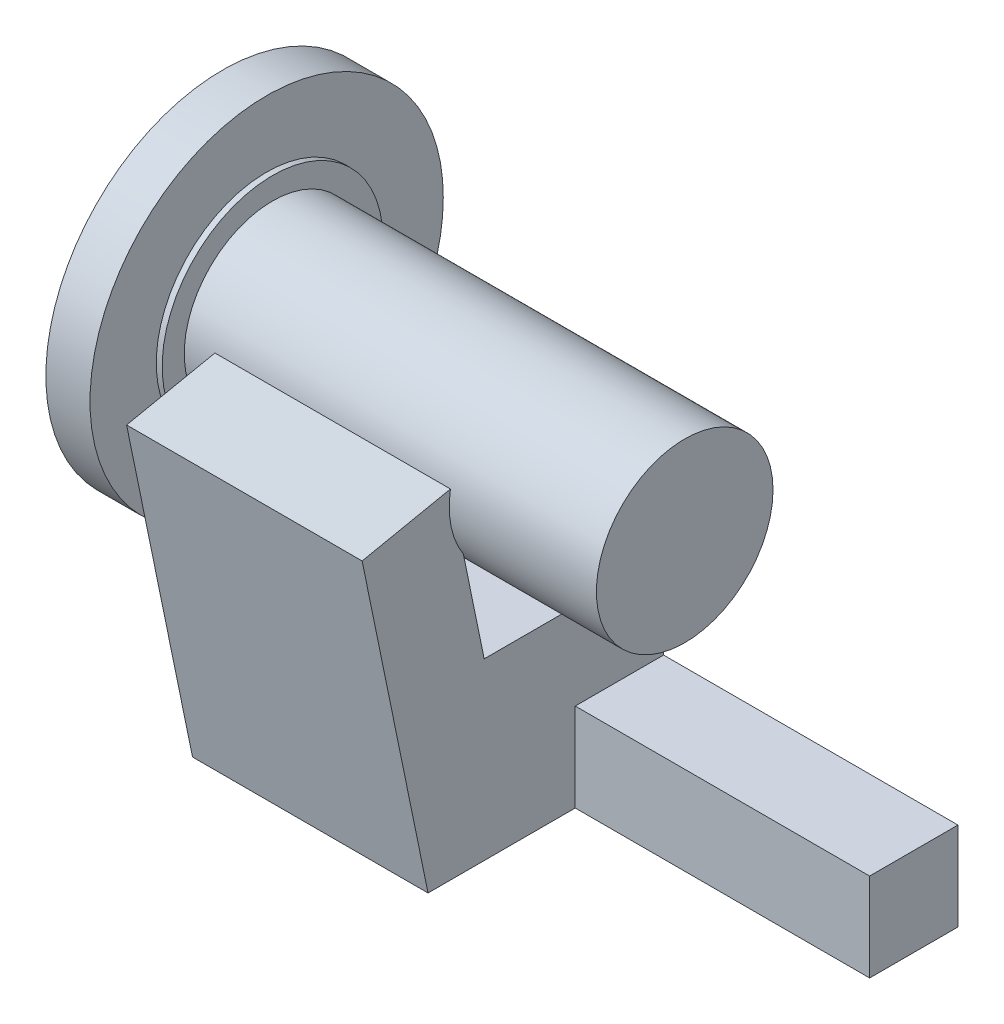
ISO-10303-21;
HEADER;
FILE_DESCRIPTION(('STEP AP214'),'2;1');
FILE_NAME('part.step','',(''),(''),'','','');
FILE_SCHEMA(('AUTOMOTIVE_DESIGN { 1 0 10303 214 1 1 1 1 }'));
ENDSEC;
DATA;
#1=APPLICATION_CONTEXT('core data for automotive mechanical design processes');
#2=APPLICATION_PROTOCOL_DEFINITION('international standard','automotive_design',2000,#1);
#3=PRODUCT_CONTEXT('',#1,'mechanical');
#4=PRODUCT('Part','Part','',(#3));
#5=PRODUCT_RELATED_PRODUCT_CATEGORY('part','',(#4));
#6=PRODUCT_DEFINITION_FORMATION('','',#4);
#7=PRODUCT_DEFINITION_CONTEXT('part definition',#1,'design');
#8=PRODUCT_DEFINITION('design','',#6,#7);
#9=PRODUCT_DEFINITION_SHAPE('','',#8);
#10=(LENGTH_UNIT() NAMED_UNIT(*) SI_UNIT(.MILLI.,.METRE.));
#11=(NAMED_UNIT(*) PLANE_ANGLE_UNIT() SI_UNIT($,.RADIAN.));
#12=(NAMED_UNIT(*) SI_UNIT($,.STERADIAN.) SOLID_ANGLE_UNIT());
#13=UNCERTAINTY_MEASURE_WITH_UNIT(LENGTH_MEASURE(1.E-05),#10,'distance_accuracy_value','');
#14=(GEOMETRIC_REPRESENTATION_CONTEXT(3) GLOBAL_UNCERTAINTY_ASSIGNED_CONTEXT((#13)) GLOBAL_UNIT_ASSIGNED_CONTEXT((#10,
#11,#12)) REPRESENTATION_CONTEXT('',''));
#15=CARTESIAN_POINT('',(0.,0.,0.));
#16=DIRECTION('',(0.,0.,1.));
#17=DIRECTION('',(1.,0.,0.));
#18=AXIS2_PLACEMENT_3D('',#15,#16,#17);
#19=CARTESIAN_POINT('',(135.89,-139.7,47.2196996677353));
#20=DIRECTION('',(0.,1.,0.));
#21=DIRECTION('',(0.,0.,1.));
#22=AXIS2_PLACEMENT_3D('',#19,#20,#21);
#23=PLANE('',#22);
#24=CARTESIAN_POINT('',(40.64,-139.7,-48.0303003322647));
#25=DIRECTION('',(0.,-1.,0.));
#26=DIRECTION('',(0.,0.,-1.));
#27=AXIS2_PLACEMENT_3D('',#24,#25,#26);
#28=CIRCLE('',#27,6.35);
#29=CARTESIAN_POINT('',(40.64,-139.7,-54.3803003322647));
#30=VERTEX_POINT('',#29);
#31=CARTESIAN_POINT('',(34.29,-139.7,-48.0303003322647));
#32=VERTEX_POINT('',#31);
#33=EDGE_CURVE('E50',#30,#32,#28,.T.);
#34=ORIENTED_EDGE('',*,*,#33,.F.);
#35=DIRECTION('',(-1.,0.,0.));
#36=VECTOR('',#35,1.);
#37=CARTESIAN_POINT('',(135.89,-139.7,-54.3803003322647));
#38=LINE('',#37,#36);
#39=CARTESIAN_POINT('',(262.89,-139.7,-54.3803003322647));
#40=VERTEX_POINT('',#39);
#41=EDGE_CURVE('E154',#40,#30,#38,.T.);
#42=ORIENTED_EDGE('',*,*,#41,.F.);
#43=DIRECTION('',(0.,0.,-1.));
#44=VECTOR('',#43,1.);
#45=CARTESIAN_POINT('',(262.89,-139.7,-54.3803003322647));
#46=LINE('',#45,#44);
#47=CARTESIAN_POINT('',(262.89,-139.7,-16.2803003322647));
#48=VERTEX_POINT('',#47);
#49=EDGE_CURVE('E558',#48,#40,#46,.T.);
#50=ORIENTED_EDGE('',*,*,#49,.F.);
#51=DIRECTION('',(-1.,0.,0.));
#52=VECTOR('',#51,1.);
#53=CARTESIAN_POINT('',(262.89,-139.7,-16.2803003322647));
#54=LINE('',#53,#52);
#55=CARTESIAN_POINT('',(135.89,-139.7,-16.2803003322647));
#56=VERTEX_POINT('',#55);
#57=EDGE_CURVE('E560',#48,#56,#54,.T.);
#58=ORIENTED_EDGE('',*,*,#57,.T.);
#59=DIRECTION('',(0.,0.,-1.));
#60=VECTOR('',#59,1.);
#61=CARTESIAN_POINT('',(135.89,-139.7,47.2196996677353));
#62=LINE('',#61,#60);
#63=CARTESIAN_POINT('',(135.89,-139.7,47.2196996677353));
#64=VERTEX_POINT('',#63);
#65=EDGE_CURVE('E540',#64,#56,#62,.T.);
#66=ORIENTED_EDGE('',*,*,#65,.F.);
#67=DIRECTION('',(-1.,0.,0.));
#68=VECTOR('',#67,1.);
#69=CARTESIAN_POINT('',(135.89,-139.7,47.2196996677353));
#70=LINE('',#69,#68);
#71=CARTESIAN_POINT('',(34.29,-139.7,47.2196996677353));
#72=VERTEX_POINT('',#71);
#73=EDGE_CURVE('E165',#64,#72,#70,.T.);
#74=ORIENTED_EDGE('',*,*,#73,.T.);
#75=DIRECTION('',(0.,0.,-1.));
#76=VECTOR('',#75,1.);
#77=CARTESIAN_POINT('',(34.29,-139.7,47.2196996677353));
#78=LINE('',#77,#76);
#79=EDGE_CURVE('E176',#72,#32,#78,.T.);
#80=ORIENTED_EDGE('',*,*,#79,.T.);
#81=EDGE_LOOP('',(#34,#42,#50,#58,#66,#74,#80));
#82=FACE_BOUND('',#81,.T.);
#83=ADVANCED_FACE('F39',(#82),#23,.F.);
#84=CARTESIAN_POINT('',(135.89,-86.8248677252122,-31.8863005314087));
#85=DIRECTION('',(-1.,0.,0.));
#86=DIRECTION('',(0.,0.,1.));
#87=AXIS2_PLACEMENT_3D('',#84,#85,#86);
#88=PLANE('',#87);
#89=DIRECTION('',(0.,0.,1.));
#90=VECTOR('',#89,1.);
#91=CARTESIAN_POINT('',(135.89,-101.6,-54.3803003322647));
#92=LINE('',#91,#90);
#93=CARTESIAN_POINT('',(135.89,-101.6,-54.3803003322647));
#94=VERTEX_POINT('',#93);
#95=CARTESIAN_POINT('',(135.89,-101.6,-16.2803003322647));
#96=VERTEX_POINT('',#95);
#97=EDGE_CURVE('E545',#94,#96,#92,.T.);
#98=ORIENTED_EDGE('',*,*,#97,.F.);
#99=DIRECTION('',(0.,1.,0.));
#100=VECTOR('',#99,1.);
#101=CARTESIAN_POINT('',(135.89,-139.7,-54.3803003322647));
#102=LINE('',#101,#100);
#103=CARTESIAN_POINT('',(135.89,-87.28092842014,-54.3803003322647));
#104=VERTEX_POINT('',#103);
#105=EDGE_CURVE('E575',#94,#104,#102,.T.);
#106=ORIENTED_EDGE('',*,*,#105,.T.);
#107=CARTESIAN_POINT('',(135.89,-86.8248677252122,-31.8863005314087));
#108=DIRECTION('',(1.,0.,0.));
#109=DIRECTION('',(0.,0.,1.));
#110=AXIS2_PLACEMENT_3D('',#107,#108,#109);
#111=CIRCLE('',#110,22.4986225889134);
#112=CARTESIAN_POINT('',(135.89,-64.3267940051332,-31.7291468351346));
#113=VERTEX_POINT('',#112);
#114=EDGE_CURVE('E577',#104,#113,#111,.T.);
#115=ORIENTED_EDGE('',*,*,#114,.T.);
#116=DIRECTION('',(0.,0.,1.));
#117=VECTOR('',#116,1.);
#118=CARTESIAN_POINT('',(135.89,-64.3267940051332,23.0084777290384));
#119=LINE('',#118,#117);
#120=CARTESIAN_POINT('',(135.89,-64.3267940051332,23.0084777290384));
#121=VERTEX_POINT('',#120);
#122=EDGE_CURVE('E515',#113,#121,#119,.T.);
#123=ORIENTED_EDGE('',*,*,#122,.T.);
#124=DIRECTION('',(0.,0.979503263535458,0.201428291765052));
#125=VECTOR('',#124,1.);
#126=CARTESIAN_POINT('',(135.89,6.41501983264387,37.5560583734074));
#127=LINE('',#126,#125);
#128=CARTESIAN_POINT('',(135.89,-20.71405784,31.9771450852188));
#129=VERTEX_POINT('',#128);
#130=EDGE_CURVE('E297',#121,#129,#127,.T.);
#131=ORIENTED_EDGE('',*,*,#130,.T.);
#132=CARTESIAN_POINT('',(135.89,0.,0.));
#133=DIRECTION('',(-1.,0.,0.));
#134=DIRECTION('',(0.,0.,1.));
#135=AXIS2_PLACEMENT_3D('',#132,#133,#134);
#136=CIRCLE('',#135,38.1);
#137=CARTESIAN_POINT('',(135.89,6.41501983264387,37.5560583734074));
#138=VERTEX_POINT('',#137);
#139=EDGE_CURVE('E43',#129,#138,#136,.T.);
#140=ORIENTED_EDGE('',*,*,#139,.T.);
#141=DIRECTION('',(0.,-0.201428291765052,0.979503263535458));
#142=VECTOR('',#141,1.);
#143=CARTESIAN_POINT('',(135.89,6.41501983264387,37.5560583734074));
#144=LINE('',#143,#142);
#145=CARTESIAN_POINT('',(135.89,-1.41999021984755,75.6560583734074));
#146=VERTEX_POINT('',#145);
#147=EDGE_CURVE('E295',#138,#146,#144,.T.);
#148=ORIENTED_EDGE('',*,*,#147,.T.);
#149=DIRECTION('',(0.,-0.979503263535458,-0.201428291765052));
#150=VECTOR('',#149,1.);
#151=CARTESIAN_POINT('',(135.89,-1.41999021984755,75.6560583734074));
#152=LINE('',#151,#150);
#153=EDGE_CURVE('E306',#146,#64,#152,.T.);
#154=ORIENTED_EDGE('',*,*,#153,.T.);
#155=ORIENTED_EDGE('',*,*,#65,.T.);
#156=DIRECTION('',(0.,-1.,0.));
#157=VECTOR('',#156,1.);
#158=CARTESIAN_POINT('',(135.89,-139.7,-16.2803003322647));
#159=LINE('',#158,#157);
#160=EDGE_CURVE('E69',#96,#56,#159,.T.);
#161=ORIENTED_EDGE('',*,*,#160,.F.);
#162=EDGE_LOOP('',(#98,#106,#115,#123,#131,#140,#148,#154,#155,#161));
#163=FACE_BOUND('',#162,.T.);
#164=ADVANCED_FACE('F197',(#163),#88,.F.);
#165=CARTESIAN_POINT('',(199.39,0.,0.));
#166=DIRECTION('',(-1.,0.,0.));
#167=DIRECTION('',(0.,0.,1.));
#168=AXIS2_PLACEMENT_3D('',#165,#166,#167);
#169=CYLINDRICAL_SURFACE('',#168,38.1);
#170=CARTESIAN_POINT('',(21.59,0.,0.));
#171=DIRECTION('',(1.,0.,0.));
#172=DIRECTION('',(0.,0.,-1.));
#173=AXIS2_PLACEMENT_3D('',#170,#171,#172);
#174=CIRCLE('',#173,38.1);
#175=CARTESIAN_POINT('',(21.59,0.,-38.1));
#176=VERTEX_POINT('',#175);
#177=EDGE_CURVE('E318',#176,#176,#174,.T.);
#178=ORIENTED_EDGE('',*,*,#177,.T.);
#179=EDGE_LOOP('',(#178));
#180=FACE_BOUND('',#179,.T.);
#181=CARTESIAN_POINT('',(199.39,0.,0.));
#182=DIRECTION('',(1.,0.,0.));
#183=DIRECTION('',(0.,0.,-1.));
#184=AXIS2_PLACEMENT_3D('',#181,#182,#183);
#185=CIRCLE('',#184,38.1);
#186=CARTESIAN_POINT('',(199.39,0.,-38.1));
#187=VERTEX_POINT('',#186);
#188=EDGE_CURVE('E276',#187,#187,#185,.T.);
#189=ORIENTED_EDGE('',*,*,#188,.F.);
#190=EDGE_LOOP('',(#189));
#191=FACE_BOUND('',#190,.T.);
#192=ORIENTED_EDGE('',*,*,#139,.F.);
#193=DIRECTION('',(-1.,0.,0.));
#194=VECTOR('',#193,1.);
#195=CARTESIAN_POINT('',(199.39,-20.71405784,31.9771450852188));
#196=LINE('',#195,#194);
#197=CARTESIAN_POINT('',(34.29,-20.71405784,31.9771450852188));
#198=VERTEX_POINT('',#197);
#199=EDGE_CURVE('E283',#198,#129,#196,.F.);
#200=ORIENTED_EDGE('',*,*,#199,.F.);
#201=CARTESIAN_POINT('',(34.29,0.,0.));
#202=DIRECTION('',(-1.,0.,0.));
#203=DIRECTION('',(0.,0.,1.));
#204=AXIS2_PLACEMENT_3D('',#201,#202,#203);
#205=CIRCLE('',#204,38.1);
#206=CARTESIAN_POINT('',(34.29,6.41501983264386,37.5560583734074));
#207=VERTEX_POINT('',#206);
#208=EDGE_CURVE('E280',#198,#207,#205,.T.);
#209=ORIENTED_EDGE('',*,*,#208,.T.);
#210=DIRECTION('',(-1.,0.,0.));
#211=VECTOR('',#210,1.);
#212=CARTESIAN_POINT('',(135.89,6.41501983264387,37.5560583734074));
#213=LINE('',#212,#211);
#214=EDGE_CURVE('E300',#138,#207,#213,.T.);
#215=ORIENTED_EDGE('',*,*,#214,.F.);
#216=EDGE_LOOP('',(#192,#200,#209,#215));
#217=FACE_BOUND('',#216,.T.);
#218=ADVANCED_FACE('F202',(#180,#191,#217),#169,.T.);
#219=CARTESIAN_POINT('',(19.05,0.,0.));
#220=DIRECTION('',(-1.,0.,0.));
#221=DIRECTION('',(0.,0.,1.));
#222=AXIS2_PLACEMENT_3D('',#219,#220,#221);
#223=CYLINDRICAL_SURFACE('',#222,76.2);
#224=CARTESIAN_POINT('',(19.05,0.,0.));
#225=DIRECTION('',(1.,0.,0.));
#226=DIRECTION('',(0.,0.,-1.));
#227=AXIS2_PLACEMENT_3D('',#224,#225,#226);
#228=CIRCLE('',#227,76.2);
#229=CARTESIAN_POINT('',(19.05,0.,-76.2));
#230=VERTEX_POINT('',#229);
#231=EDGE_CURVE('E265',#230,#230,#228,.T.);
#232=ORIENTED_EDGE('',*,*,#231,.F.);
#233=EDGE_LOOP('',(#232));
#234=FACE_BOUND('',#233,.T.);
#235=CARTESIAN_POINT('',(0.,0.,0.));
#236=DIRECTION('',(1.,0.,0.));
#237=DIRECTION('',(0.,0.,-1.));
#238=AXIS2_PLACEMENT_3D('',#235,#236,#237);
#239=CIRCLE('',#238,76.2);
#240=CARTESIAN_POINT('',(0.,0.,-76.2));
#241=VERTEX_POINT('',#240);
#242=EDGE_CURVE('E262',#241,#241,#239,.T.);
#243=ORIENTED_EDGE('',*,*,#242,.T.);
#244=EDGE_LOOP('',(#243));
#245=FACE_BOUND('',#244,.T.);
#246=ADVANCED_FACE('F41',(#234,#245),#223,.T.);
#247=CARTESIAN_POINT('',(19.05,0.,0.));
#248=DIRECTION('',(1.,0.,0.));
#249=DIRECTION('',(0.,0.,-1.));
#250=AXIS2_PLACEMENT_3D('',#247,#248,#249);
#251=PLANE('',#250);
#252=CARTESIAN_POINT('',(19.05,0.,0.));
#253=DIRECTION('',(1.,0.,0.));
#254=DIRECTION('',(0.,0.,-1.));
#255=AXIS2_PLACEMENT_3D('',#252,#253,#254);
#256=CIRCLE('',#255,47.625);
#257=CARTESIAN_POINT('',(19.05,0.,-47.625));
#258=VERTEX_POINT('',#257);
#259=EDGE_CURVE('E272',#258,#258,#256,.T.);
#260=ORIENTED_EDGE('',*,*,#259,.F.);
#261=EDGE_LOOP('',(#260));
#262=FACE_BOUND('',#261,.T.);
#263=ORIENTED_EDGE('',*,*,#231,.T.);
#264=EDGE_LOOP('',(#263));
#265=FACE_BOUND('',#264,.T.);
#266=ADVANCED_FACE('F249',(#262,#265),#251,.T.);
#267=CARTESIAN_POINT('',(0.,0.,0.));
#268=DIRECTION('',(1.,0.,0.));
#269=DIRECTION('',(0.,0.,-1.));
#270=AXIS2_PLACEMENT_3D('',#267,#268,#269);
#271=PLANE('',#270);
#272=CARTESIAN_POINT('',(0.,0.,0.));
#273=DIRECTION('',(-1.,0.,0.));
#274=DIRECTION('',(0.,0.,1.));
#275=AXIS2_PLACEMENT_3D('',#272,#273,#274);
#276=CIRCLE('',#275,12.7);
#277=CARTESIAN_POINT('',(0.,0.,12.7));
#278=VERTEX_POINT('',#277);
#279=EDGE_CURVE('E259',#278,#278,#276,.T.);
#280=ORIENTED_EDGE('',*,*,#279,.F.);
#281=EDGE_LOOP('',(#280));
#282=FACE_BOUND('',#281,.T.);
#283=ORIENTED_EDGE('',*,*,#242,.F.);
#284=EDGE_LOOP('',(#283));
#285=FACE_BOUND('',#284,.T.);
#286=ADVANCED_FACE('F247',(#282,#285),#271,.F.);
#287=CARTESIAN_POINT('',(21.59,0.,0.));
#288=DIRECTION('',(-1.,0.,0.));
#289=DIRECTION('',(0.,0.,1.));
#290=AXIS2_PLACEMENT_3D('',#287,#288,#289);
#291=CYLINDRICAL_SURFACE('',#290,47.625);
#292=CARTESIAN_POINT('',(21.59,0.,0.));
#293=DIRECTION('',(1.,0.,0.));
#294=DIRECTION('',(0.,0.,-1.));
#295=AXIS2_PLACEMENT_3D('',#292,#293,#294);
#296=CIRCLE('',#295,47.625);
#297=CARTESIAN_POINT('',(21.59,0.,-47.625));
#298=VERTEX_POINT('',#297);
#299=EDGE_CURVE('E266',#298,#298,#296,.T.);
#300=ORIENTED_EDGE('',*,*,#299,.F.);
#301=EDGE_LOOP('',(#300));
#302=FACE_BOUND('',#301,.T.);
#303=ORIENTED_EDGE('',*,*,#259,.T.);
#304=EDGE_LOOP('',(#303));
#305=FACE_BOUND('',#304,.T.);
#306=ADVANCED_FACE('F243',(#302,#305),#291,.T.);
#307=CARTESIAN_POINT('',(21.59,0.,0.));
#308=DIRECTION('',(1.,0.,0.));
#309=DIRECTION('',(0.,0.,-1.));
#310=AXIS2_PLACEMENT_3D('',#307,#308,#309);
#311=PLANE('',#310);
#312=ORIENTED_EDGE('',*,*,#177,.F.);
#313=EDGE_LOOP('',(#312));
#314=FACE_BOUND('',#313,.T.);
#315=ORIENTED_EDGE('',*,*,#299,.T.);
#316=EDGE_LOOP('',(#315));
#317=FACE_BOUND('',#316,.T.);
#318=ADVANCED_FACE('F236',(#314,#317),#311,.T.);
#319=CARTESIAN_POINT('',(199.39,0.,0.));
#320=DIRECTION('',(1.,0.,0.));
#321=DIRECTION('',(0.,0.,-1.));
#322=AXIS2_PLACEMENT_3D('',#319,#320,#321);
#323=PLANE('',#322);
#324=ORIENTED_EDGE('',*,*,#188,.T.);
#325=EDGE_LOOP('',(#324));
#326=FACE_BOUND('',#325,.T.);
#327=ADVANCED_FACE('F232',(#326),#323,.T.);
#328=CARTESIAN_POINT('',(-31.75,0.,0.));
#329=DIRECTION('',(1.,0.,0.));
#330=DIRECTION('',(0.,0.,-1.));
#331=AXIS2_PLACEMENT_3D('',#328,#329,#330);
#332=CYLINDRICAL_SURFACE('',#331,12.7);
#333=CARTESIAN_POINT('',(-31.75,0.,0.));
#334=DIRECTION('',(-1.,0.,0.));
#335=DIRECTION('',(0.,0.,1.));
#336=AXIS2_PLACEMENT_3D('',#333,#334,#335);
#337=CIRCLE('',#336,12.7);
#338=CARTESIAN_POINT('',(-31.75,0.,12.7));
#339=VERTEX_POINT('',#338);
#340=EDGE_CURVE('E308',#339,#339,#337,.T.);
#341=ORIENTED_EDGE('',*,*,#340,.F.);
#342=EDGE_LOOP('',(#341));
#343=FACE_BOUND('',#342,.T.);
#344=ORIENTED_EDGE('',*,*,#279,.T.);
#345=EDGE_LOOP('',(#344));
#346=FACE_BOUND('',#345,.T.);
#347=ADVANCED_FACE('F228',(#343,#346),#332,.T.);
#348=CARTESIAN_POINT('',(-31.75,0.,0.));
#349=DIRECTION('',(-1.,0.,0.));
#350=DIRECTION('',(0.,0.,1.));
#351=AXIS2_PLACEMENT_3D('',#348,#349,#350);
#352=PLANE('',#351);
#353=ORIENTED_EDGE('',*,*,#340,.T.);
#354=EDGE_LOOP('',(#353));
#355=FACE_BOUND('',#354,.T.);
#356=ADVANCED_FACE('F224',(#355),#352,.T.);
#357=CARTESIAN_POINT('',(135.89,6.41501983264387,37.5560583734074));
#358=DIRECTION('',(0.,-0.201428291765052,0.979503263535458));
#359=DIRECTION('',(0.,-0.979503263535458,-0.201428291765052));
#360=AXIS2_PLACEMENT_3D('',#357,#358,#359);
#361=PLANE('',#360);
#362=DIRECTION('',(0.,0.979503263535458,0.201428291765052));
#363=VECTOR('',#362,1.);
#364=CARTESIAN_POINT('',(34.29,6.41501983264387,37.5560583734074));
#365=LINE('',#364,#363);
#366=CARTESIAN_POINT('',(34.29,-64.3267940051332,23.0084777290384));
#367=VERTEX_POINT('',#366);
#368=EDGE_CURVE('E497',#367,#198,#365,.T.);
#369=ORIENTED_EDGE('',*,*,#368,.T.);
#370=ORIENTED_EDGE('',*,*,#199,.T.);
#371=ORIENTED_EDGE('',*,*,#130,.F.);
#372=DIRECTION('',(-1.,0.,0.));
#373=VECTOR('',#372,1.);
#374=CARTESIAN_POINT('',(135.89,-64.3267940051332,23.0084777290384));
#375=LINE('',#374,#373);
#376=EDGE_CURVE('E502',#121,#367,#375,.T.);
#377=ORIENTED_EDGE('',*,*,#376,.T.);
#378=EDGE_LOOP('',(#369,#370,#371,#377));
#379=FACE_BOUND('',#378,.T.);
#380=ADVANCED_FACE('F218',(#379),#361,.F.);
#381=CARTESIAN_POINT('',(135.89,6.41501983264387,37.5560583734074));
#382=DIRECTION('',(0.,-0.979503263535458,-0.201428291765052));
#383=DIRECTION('',(0.,0.201428291765052,-0.979503263535458));
#384=AXIS2_PLACEMENT_3D('',#381,#382,#383);
#385=PLANE('',#384);
#386=DIRECTION('',(0.,-0.201428291765052,0.979503263535458));
#387=VECTOR('',#386,1.);
#388=CARTESIAN_POINT('',(34.29,6.41501983264387,37.5560583734074));
#389=LINE('',#388,#387);
#390=CARTESIAN_POINT('',(34.29,-1.41999021984755,75.6560583734074));
#391=VERTEX_POINT('',#390);
#392=EDGE_CURVE('E499',#207,#391,#389,.T.);
#393=ORIENTED_EDGE('',*,*,#392,.T.);
#394=DIRECTION('',(-1.,0.,0.));
#395=VECTOR('',#394,1.);
#396=CARTESIAN_POINT('',(135.89,-1.41999021984755,75.6560583734074));
#397=LINE('',#396,#395);
#398=EDGE_CURVE('E303',#146,#391,#397,.T.);
#399=ORIENTED_EDGE('',*,*,#398,.F.);
#400=ORIENTED_EDGE('',*,*,#147,.F.);
#401=ORIENTED_EDGE('',*,*,#214,.T.);
#402=EDGE_LOOP('',(#393,#399,#400,#401));
#403=FACE_BOUND('',#402,.T.);
#404=ADVANCED_FACE('F213',(#403),#385,.F.);
#405=CARTESIAN_POINT('',(135.89,-1.41999021984755,75.6560583734074));
#406=DIRECTION('',(0.,0.201428291765052,-0.979503263535458));
#407=DIRECTION('',(0.,0.979503263535458,0.201428291765052));
#408=AXIS2_PLACEMENT_3D('',#405,#406,#407);
#409=PLANE('',#408);
#410=DIRECTION('',(0.,-0.979503263535458,-0.201428291765052));
#411=VECTOR('',#410,1.);
#412=CARTESIAN_POINT('',(34.29,-1.41999021984755,75.6560583734074));
#413=LINE('',#412,#411);
#414=EDGE_CURVE('E508',#391,#72,#413,.T.);
#415=ORIENTED_EDGE('',*,*,#414,.T.);
#416=ORIENTED_EDGE('',*,*,#73,.F.);
#417=ORIENTED_EDGE('',*,*,#153,.F.);
#418=ORIENTED_EDGE('',*,*,#398,.T.);
#419=EDGE_LOOP('',(#415,#416,#417,#418));
#420=FACE_BOUND('',#419,.T.);
#421=ADVANCED_FACE('F207',(#420),#409,.F.);
#422=EDGE_CURVE('E11',#32,#30,#28,.T.);
#423=ORIENTED_EDGE('',*,*,#422,.F.);
#424=CARTESIAN_POINT('',(34.29,-139.7,-54.3803003322647));
#425=VERTEX_POINT('',#424);
#426=EDGE_CURVE('E168',#32,#425,#78,.T.);
#427=ORIENTED_EDGE('',*,*,#426,.T.);
#428=EDGE_CURVE('E156',#30,#425,#38,.T.);
#429=ORIENTED_EDGE('',*,*,#428,.F.);
#430=EDGE_LOOP('',(#423,#427,#429));
#431=FACE_BOUND('',#430,.T.);
#432=ADVANCED_FACE('F167',(#431),#23,.F.);
#433=CARTESIAN_POINT('',(135.89,-87.28092842014,-54.3803003322647));
#434=DIRECTION('',(0.,0.,1.));
#435=DIRECTION('',(1.,0.,0.));
#436=AXIS2_PLACEMENT_3D('',#433,#434,#435);
#437=PLANE('',#436);
#438=DIRECTION('',(0.,1.,0.));
#439=VECTOR('',#438,1.);
#440=CARTESIAN_POINT('',(34.29,-87.28092842014,-54.3803003322647));
#441=LINE('',#440,#439);
#442=CARTESIAN_POINT('',(34.29,-87.28092842014,-54.3803003322647));
#443=VERTEX_POINT('',#442);
#444=EDGE_CURVE('E521',#425,#443,#441,.T.);
#445=ORIENTED_EDGE('',*,*,#444,.T.);
#446=DIRECTION('',(-1.,0.,0.));
#447=VECTOR('',#446,1.);
#448=CARTESIAN_POINT('',(135.89,-87.28092842014,-54.3803003322647));
#449=LINE('',#448,#447);
#450=EDGE_CURVE('E171',#104,#443,#449,.T.);
#451=ORIENTED_EDGE('',*,*,#450,.F.);
#452=ORIENTED_EDGE('',*,*,#105,.F.);
#453=DIRECTION('',(-1.,0.,0.));
#454=VECTOR('',#453,1.);
#455=CARTESIAN_POINT('',(262.89,-101.6,-54.3803003322647));
#456=LINE('',#455,#454);
#457=CARTESIAN_POINT('',(262.89,-101.6,-54.3803003322647));
#458=VERTEX_POINT('',#457);
#459=EDGE_CURVE('E504',#458,#94,#456,.T.);
#460=ORIENTED_EDGE('',*,*,#459,.F.);
#461=DIRECTION('',(0.,1.,0.));
#462=VECTOR('',#461,1.);
#463=CARTESIAN_POINT('',(262.89,-139.7,-54.3803003322647));
#464=LINE('',#463,#462);
#465=EDGE_CURVE('E159',#40,#458,#464,.T.);
#466=ORIENTED_EDGE('',*,*,#465,.F.);
#467=ORIENTED_EDGE('',*,*,#41,.T.);
#468=ORIENTED_EDGE('',*,*,#428,.T.);
#469=EDGE_LOOP('',(#445,#451,#452,#460,#466,#467,#468));
#470=FACE_BOUND('',#469,.T.);
#471=ADVANCED_FACE('F155',(#470),#437,.F.);
#472=CARTESIAN_POINT('',(135.89,-86.8248677252122,-31.8863005314087));
#473=DIRECTION('',(-1.,0.,0.));
#474=DIRECTION('',(0.,0.,1.));
#475=AXIS2_PLACEMENT_3D('',#472,#473,#474);
#476=CYLINDRICAL_SURFACE('',#475,22.4986225889134);
#477=CARTESIAN_POINT('',(34.29,-86.8248677252122,-31.8863005314087));
#478=DIRECTION('',(1.,0.,0.));
#479=DIRECTION('',(0.,0.,1.));
#480=AXIS2_PLACEMENT_3D('',#477,#478,#479);
#481=CIRCLE('',#480,22.4986225889134);
#482=CARTESIAN_POINT('',(34.29,-64.3267940051332,-31.7291468351346));
#483=VERTEX_POINT('',#482);
#484=EDGE_CURVE('E524',#443,#483,#481,.T.);
#485=ORIENTED_EDGE('',*,*,#484,.T.);
#486=DIRECTION('',(-1.,0.,0.));
#487=VECTOR('',#486,1.);
#488=CARTESIAN_POINT('',(135.89,-64.3267940051332,-31.7291468351346));
#489=LINE('',#488,#487);
#490=EDGE_CURVE('E531',#113,#483,#489,.T.);
#491=ORIENTED_EDGE('',*,*,#490,.F.);
#492=ORIENTED_EDGE('',*,*,#114,.F.);
#493=ORIENTED_EDGE('',*,*,#450,.T.);
#494=EDGE_LOOP('',(#485,#491,#492,#493));
#495=FACE_BOUND('',#494,.T.);
#496=ADVANCED_FACE('F212',(#495),#476,.T.);
#497=CARTESIAN_POINT('',(135.89,-64.3267940051332,23.0084777290384));
#498=DIRECTION('',(0.,-1.,0.));
#499=DIRECTION('',(0.,0.,-1.));
#500=AXIS2_PLACEMENT_3D('',#497,#498,#499);
#501=PLANE('',#500);
#502=DIRECTION('',(0.,0.,1.));
#503=VECTOR('',#502,1.);
#504=CARTESIAN_POINT('',(34.29,-64.3267940051332,23.0084777290384));
#505=LINE('',#504,#503);
#506=EDGE_CURVE('E527',#483,#367,#505,.T.);
#507=ORIENTED_EDGE('',*,*,#506,.T.);
#508=ORIENTED_EDGE('',*,*,#376,.F.);
#509=ORIENTED_EDGE('',*,*,#122,.F.);
#510=ORIENTED_EDGE('',*,*,#490,.T.);
#511=EDGE_LOOP('',(#507,#508,#509,#510));
#512=FACE_BOUND('',#511,.T.);
#513=ADVANCED_FACE('F412',(#512),#501,.F.);
#514=CARTESIAN_POINT('',(34.29,-86.8248677252122,-31.8863005314087));
#515=DIRECTION('',(-1.,0.,0.));
#516=DIRECTION('',(0.,0.,1.));
#517=AXIS2_PLACEMENT_3D('',#514,#515,#516);
#518=PLANE('',#517);
#519=ORIENTED_EDGE('',*,*,#208,.F.);
#520=ORIENTED_EDGE('',*,*,#368,.F.);
#521=ORIENTED_EDGE('',*,*,#506,.F.);
#522=ORIENTED_EDGE('',*,*,#484,.F.);
#523=ORIENTED_EDGE('',*,*,#444,.F.);
#524=ORIENTED_EDGE('',*,*,#426,.F.);
#525=ORIENTED_EDGE('',*,*,#79,.F.);
#526=ORIENTED_EDGE('',*,*,#414,.F.);
#527=ORIENTED_EDGE('',*,*,#392,.F.);
#528=EDGE_LOOP('',(#519,#520,#521,#522,#523,#524,#525,#526,#527));
#529=FACE_BOUND('',#528,.T.);
#530=ADVANCED_FACE('F424',(#529),#518,.T.);
#531=CARTESIAN_POINT('',(262.89,-101.6,-54.3803003322647));
#532=DIRECTION('',(0.,-1.,0.));
#533=DIRECTION('',(0.,0.,-1.));
#534=AXIS2_PLACEMENT_3D('',#531,#532,#533);
#535=PLANE('',#534);
#536=ORIENTED_EDGE('',*,*,#97,.T.);
#537=DIRECTION('',(-1.,0.,0.));
#538=VECTOR('',#537,1.);
#539=CARTESIAN_POINT('',(262.89,-101.6,-16.2803003322647));
#540=LINE('',#539,#538);
#541=CARTESIAN_POINT('',(262.89,-101.6,-16.2803003322647));
#542=VERTEX_POINT('',#541);
#543=EDGE_CURVE('E512',#542,#96,#540,.T.);
#544=ORIENTED_EDGE('',*,*,#543,.F.);
#545=DIRECTION('',(0.,0.,1.));
#546=VECTOR('',#545,1.);
#547=CARTESIAN_POINT('',(262.89,-101.6,-54.3803003322647));
#548=LINE('',#547,#546);
#549=EDGE_CURVE('E552',#458,#542,#548,.T.);
#550=ORIENTED_EDGE('',*,*,#549,.F.);
#551=ORIENTED_EDGE('',*,*,#459,.T.);
#552=EDGE_LOOP('',(#536,#544,#550,#551));
#553=FACE_BOUND('',#552,.T.);
#554=ADVANCED_FACE('F436',(#553),#535,.F.);
#555=CARTESIAN_POINT('',(262.89,-139.7,-16.2803003322647));
#556=DIRECTION('',(0.,0.,-1.));
#557=DIRECTION('',(-1.,0.,0.));
#558=AXIS2_PLACEMENT_3D('',#555,#556,#557);
#559=PLANE('',#558);
#560=ORIENTED_EDGE('',*,*,#160,.T.);
#561=ORIENTED_EDGE('',*,*,#57,.F.);
#562=DIRECTION('',(0.,-1.,0.));
#563=VECTOR('',#562,1.);
#564=CARTESIAN_POINT('',(262.89,-139.7,-16.2803003322647));
#565=LINE('',#564,#563);
#566=EDGE_CURVE('E555',#542,#48,#565,.T.);
#567=ORIENTED_EDGE('',*,*,#566,.F.);
#568=ORIENTED_EDGE('',*,*,#543,.T.);
#569=EDGE_LOOP('',(#560,#561,#567,#568));
#570=FACE_BOUND('',#569,.T.);
#571=ADVANCED_FACE('F192',(#570),#559,.F.);
#572=CARTESIAN_POINT('',(262.89,0.,0.));
#573=DIRECTION('',(1.,0.,0.));
#574=DIRECTION('',(0.,0.,-1.));
#575=AXIS2_PLACEMENT_3D('',#572,#573,#574);
#576=PLANE('',#575);
#577=ORIENTED_EDGE('',*,*,#465,.T.);
#578=ORIENTED_EDGE('',*,*,#549,.T.);
#579=ORIENTED_EDGE('',*,*,#566,.T.);
#580=ORIENTED_EDGE('',*,*,#49,.T.);
#581=EDGE_LOOP('',(#577,#578,#579,#580));
#582=FACE_BOUND('',#581,.T.);
#583=ADVANCED_FACE('F183',(#582),#576,.T.);
#584=CARTESIAN_POINT('',(40.64,-142.24,-48.0303003322647));
#585=DIRECTION('',(0.,1.,0.));
#586=DIRECTION('',(0.,0.,1.));
#587=AXIS2_PLACEMENT_3D('',#584,#585,#586);
#588=CYLINDRICAL_SURFACE('',#587,6.35);
#589=CARTESIAN_POINT('',(40.64,-142.24,-48.0303003322647));
#590=DIRECTION('',(0.,-1.,0.));
#591=DIRECTION('',(0.,0.,-1.));
#592=AXIS2_PLACEMENT_3D('',#589,#590,#591);
#593=CIRCLE('',#592,6.35);
#594=CARTESIAN_POINT('',(40.64,-142.24,-54.3803003322647));
#595=VERTEX_POINT('',#594);
#596=EDGE_CURVE('E179',#595,#595,#593,.T.);
#597=ORIENTED_EDGE('',*,*,#596,.F.);
#598=EDGE_LOOP('',(#597));
#599=FACE_BOUND('',#598,.T.);
#600=ORIENTED_EDGE('',*,*,#33,.T.);
#601=ORIENTED_EDGE('',*,*,#422,.T.);
#602=EDGE_LOOP('',(#600,#601));
#603=FACE_BOUND('',#602,.T.);
#604=ADVANCED_FACE('F180',(#599,#603),#588,.T.);
#605=CARTESIAN_POINT('',(40.64,-142.24,-48.0303003322647));
#606=DIRECTION('',(0.,-1.,0.));
#607=DIRECTION('',(0.,0.,-1.));
#608=AXIS2_PLACEMENT_3D('',#605,#606,#607);
#609=PLANE('',#608);
#610=ORIENTED_EDGE('',*,*,#596,.T.);
#611=EDGE_LOOP('',(#610));
#612=FACE_BOUND('',#611,.T.);
#613=ADVANCED_FACE('F182',(#612),#609,.T.);
#614=CLOSED_SHELL('',(#83,#164,#218,#246,#266,#286,#306,#318,#327,#347,#356,#380,#404,#421,#432,
#471,#496,#513,#530,#554,#571,#583,#604,#613));
#615=MANIFOLD_SOLID_BREP('B2',#614);
#616=ADVANCED_BREP_SHAPE_REPRESENTATION('',(#18,#615),#14);
#617=SHAPE_DEFINITION_REPRESENTATION(#9,#616);
ENDSEC;
END-ISO-10303-21;
